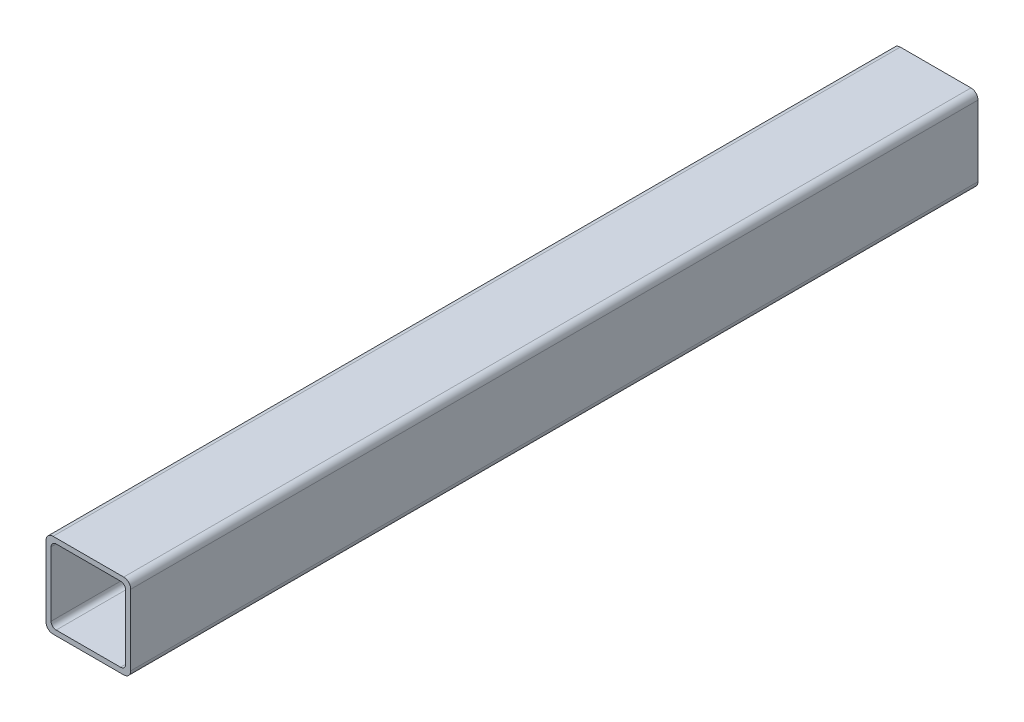
ISO-10303-21;
HEADER;
FILE_DESCRIPTION(('STEP AP214'),'2;1');
FILE_NAME('part.step','',(''),(''),'','','');
FILE_SCHEMA(('AUTOMOTIVE_DESIGN { 1 0 10303 214 1 1 1 1 }'));
ENDSEC;
DATA;
#1=APPLICATION_CONTEXT('core data for automotive mechanical design processes');
#2=APPLICATION_PROTOCOL_DEFINITION('international standard','automotive_design',2000,#1);
#3=PRODUCT_CONTEXT('',#1,'mechanical');
#4=PRODUCT('Part','Part','',(#3));
#5=PRODUCT_RELATED_PRODUCT_CATEGORY('part','',(#4));
#6=PRODUCT_DEFINITION_FORMATION('','',#4);
#7=PRODUCT_DEFINITION_CONTEXT('part definition',#1,'design');
#8=PRODUCT_DEFINITION('design','',#6,#7);
#9=PRODUCT_DEFINITION_SHAPE('','',#8);
#10=(LENGTH_UNIT() NAMED_UNIT(*) SI_UNIT(.MILLI.,.METRE.));
#11=(NAMED_UNIT(*) PLANE_ANGLE_UNIT() SI_UNIT($,.RADIAN.));
#12=(NAMED_UNIT(*) SI_UNIT($,.STERADIAN.) SOLID_ANGLE_UNIT());
#13=UNCERTAINTY_MEASURE_WITH_UNIT(LENGTH_MEASURE(1.E-05),#10,'distance_accuracy_value','');
#14=(GEOMETRIC_REPRESENTATION_CONTEXT(3) GLOBAL_UNCERTAINTY_ASSIGNED_CONTEXT((#13)) GLOBAL_UNIT_ASSIGNED_CONTEXT((#10,
#11,#12)) REPRESENTATION_CONTEXT('',''));
#15=CARTESIAN_POINT('',(0.,0.,0.));
#16=DIRECTION('',(0.,0.,1.));
#17=DIRECTION('',(1.,0.,0.));
#18=AXIS2_PLACEMENT_3D('',#15,#16,#17);
#19=CARTESIAN_POINT('',(-10.5917999999984,-10.5917999999984,-3429.));
#20=DIRECTION('',(0.,0.,-1.));
#21=DIRECTION('',(-1.,0.,0.));
#22=AXIS2_PLACEMENT_3D('',#19,#20,#21);
#23=CYLINDRICAL_SURFACE('',#22,2.10820000000163);
#24=CARTESIAN_POINT('',(-10.5917999999984,-10.5917999999984,-3683.));
#25=DIRECTION('',(0.,0.,-1.));
#26=DIRECTION('',(-1.,0.,0.));
#27=AXIS2_PLACEMENT_3D('',#24,#25,#26);
#28=CIRCLE('',#27,2.10820000000163);
#29=CARTESIAN_POINT('',(-10.5917999999984,-12.7,-3683.));
#30=VERTEX_POINT('',#29);
#31=CARTESIAN_POINT('',(-12.7,-10.5917999999984,-3683.));
#32=VERTEX_POINT('',#31);
#33=EDGE_CURVE('E202',#30,#32,#28,.T.);
#34=ORIENTED_EDGE('',*,*,#33,.F.);
#35=DIRECTION('',(0.,0.,-1.));
#36=VECTOR('',#35,1.);
#37=CARTESIAN_POINT('',(-10.5917999999984,-12.7,-3429.));
#38=LINE('',#37,#36);
#39=CARTESIAN_POINT('',(-10.5917999999984,-12.7,-3429.));
#40=VERTEX_POINT('',#39);
#41=EDGE_CURVE('E11',#40,#30,#38,.T.);
#42=ORIENTED_EDGE('',*,*,#41,.F.);
#43=CARTESIAN_POINT('',(-10.5917999999984,-10.5917999999984,-3429.));
#44=DIRECTION('',(0.,0.,-1.));
#45=DIRECTION('',(-1.,0.,0.));
#46=AXIS2_PLACEMENT_3D('',#43,#44,#45);
#47=CIRCLE('',#46,2.10820000000163);
#48=CARTESIAN_POINT('',(-12.7,-10.5917999999984,-3429.));
#49=VERTEX_POINT('',#48);
#50=EDGE_CURVE('E214',#40,#49,#47,.T.);
#51=ORIENTED_EDGE('',*,*,#50,.T.);
#52=DIRECTION('',(0.,0.,-1.));
#53=VECTOR('',#52,1.);
#54=CARTESIAN_POINT('',(-12.7,-10.5917999999984,-3429.));
#55=LINE('',#54,#53);
#56=EDGE_CURVE('E35',#49,#32,#55,.T.);
#57=ORIENTED_EDGE('',*,*,#56,.T.);
#58=EDGE_LOOP('',(#34,#42,#51,#57));
#59=FACE_BOUND('',#58,.T.);
#60=ADVANCED_FACE('F32',(#59),#23,.T.);
#61=CARTESIAN_POINT('',(10.5917999999984,-12.7,-3429.));
#62=DIRECTION('',(0.,-1.,0.));
#63=DIRECTION('',(1.,0.,0.));
#64=AXIS2_PLACEMENT_3D('',#61,#62,#63);
#65=PLANE('',#64);
#66=DIRECTION('',(-1.,0.,0.));
#67=VECTOR('',#66,1.);
#68=CARTESIAN_POINT('',(10.5917999999984,-12.7,-3683.));
#69=LINE('',#68,#67);
#70=CARTESIAN_POINT('',(10.5917999999984,-12.7,-3683.));
#71=VERTEX_POINT('',#70);
#72=EDGE_CURVE('E218',#71,#30,#69,.T.);
#73=ORIENTED_EDGE('',*,*,#72,.F.);
#74=DIRECTION('',(0.,0.,-1.));
#75=VECTOR('',#74,1.);
#76=CARTESIAN_POINT('',(10.5917999999984,-12.7,-3429.));
#77=LINE('',#76,#75);
#78=CARTESIAN_POINT('',(10.5917999999984,-12.7,-3429.));
#79=VERTEX_POINT('',#78);
#80=EDGE_CURVE('E40',#79,#71,#77,.T.);
#81=ORIENTED_EDGE('',*,*,#80,.F.);
#82=DIRECTION('',(-1.,0.,0.));
#83=VECTOR('',#82,1.);
#84=CARTESIAN_POINT('',(10.5917999999984,-12.7,-3429.));
#85=LINE('',#84,#83);
#86=EDGE_CURVE('E236',#79,#40,#85,.T.);
#87=ORIENTED_EDGE('',*,*,#86,.T.);
#88=ORIENTED_EDGE('',*,*,#41,.T.);
#89=EDGE_LOOP('',(#73,#81,#87,#88));
#90=FACE_BOUND('',#89,.T.);
#91=ADVANCED_FACE('F283',(#90),#65,.T.);
#92=CARTESIAN_POINT('',(10.5917999999984,-10.5917999999984,-3429.));
#93=DIRECTION('',(0.,0.,-1.));
#94=DIRECTION('',(-1.,0.,0.));
#95=AXIS2_PLACEMENT_3D('',#92,#93,#94);
#96=CYLINDRICAL_SURFACE('',#95,2.10820000000163);
#97=CARTESIAN_POINT('',(10.5917999999984,-10.5917999999984,-3683.));
#98=DIRECTION('',(0.,0.,-1.));
#99=DIRECTION('',(-1.,0.,0.));
#100=AXIS2_PLACEMENT_3D('',#97,#98,#99);
#101=CIRCLE('',#100,2.10820000000163);
#102=CARTESIAN_POINT('',(12.7,-10.5917999999984,-3683.));
#103=VERTEX_POINT('',#102);
#104=EDGE_CURVE('E256',#103,#71,#101,.T.);
#105=ORIENTED_EDGE('',*,*,#104,.F.);
#106=DIRECTION('',(0.,0.,-1.));
#107=VECTOR('',#106,1.);
#108=CARTESIAN_POINT('',(12.7,-10.5917999999984,-3429.));
#109=LINE('',#108,#107);
#110=CARTESIAN_POINT('',(12.7,-10.5917999999984,-3429.));
#111=VERTEX_POINT('',#110);
#112=EDGE_CURVE('E262',#111,#103,#109,.T.);
#113=ORIENTED_EDGE('',*,*,#112,.F.);
#114=CARTESIAN_POINT('',(10.5917999999984,-10.5917999999984,-3429.));
#115=DIRECTION('',(0.,0.,-1.));
#116=DIRECTION('',(-1.,0.,0.));
#117=AXIS2_PLACEMENT_3D('',#114,#115,#116);
#118=CIRCLE('',#117,2.10820000000163);
#119=EDGE_CURVE('E233',#111,#79,#118,.T.);
#120=ORIENTED_EDGE('',*,*,#119,.T.);
#121=ORIENTED_EDGE('',*,*,#80,.T.);
#122=EDGE_LOOP('',(#105,#113,#120,#121));
#123=FACE_BOUND('',#122,.T.);
#124=ADVANCED_FACE('F302',(#123),#96,.T.);
#125=CARTESIAN_POINT('',(12.7,10.5917999999984,-3429.));
#126=DIRECTION('',(1.,0.,0.));
#127=DIRECTION('',(0.,1.,0.));
#128=AXIS2_PLACEMENT_3D('',#125,#126,#127);
#129=PLANE('',#128);
#130=DIRECTION('',(0.,-1.,0.));
#131=VECTOR('',#130,1.);
#132=CARTESIAN_POINT('',(12.7,10.5917999999984,-3683.));
#133=LINE('',#132,#131);
#134=CARTESIAN_POINT('',(12.7,10.5917999999984,-3683.));
#135=VERTEX_POINT('',#134);
#136=EDGE_CURVE('E253',#135,#103,#133,.T.);
#137=ORIENTED_EDGE('',*,*,#136,.F.);
#138=DIRECTION('',(0.,0.,-1.));
#139=VECTOR('',#138,1.);
#140=CARTESIAN_POINT('',(12.7,10.5917999999984,-3429.));
#141=LINE('',#140,#139);
#142=CARTESIAN_POINT('',(12.7,10.5917999999984,-3429.));
#143=VERTEX_POINT('',#142);
#144=EDGE_CURVE('E264',#143,#135,#141,.T.);
#145=ORIENTED_EDGE('',*,*,#144,.F.);
#146=DIRECTION('',(0.,-1.,0.));
#147=VECTOR('',#146,1.);
#148=CARTESIAN_POINT('',(12.7,10.5917999999984,-3429.));
#149=LINE('',#148,#147);
#150=EDGE_CURVE('E230',#143,#111,#149,.T.);
#151=ORIENTED_EDGE('',*,*,#150,.T.);
#152=ORIENTED_EDGE('',*,*,#112,.T.);
#153=EDGE_LOOP('',(#137,#145,#151,#152));
#154=FACE_BOUND('',#153,.T.);
#155=ADVANCED_FACE('F300',(#154),#129,.T.);
#156=CARTESIAN_POINT('',(10.5917999999984,10.5917999999984,-3429.));
#157=DIRECTION('',(0.,0.,-1.));
#158=DIRECTION('',(-1.,0.,0.));
#159=AXIS2_PLACEMENT_3D('',#156,#157,#158);
#160=CYLINDRICAL_SURFACE('',#159,2.10820000000163);
#161=CARTESIAN_POINT('',(10.5917999999984,10.5917999999984,-3683.));
#162=DIRECTION('',(0.,0.,-1.));
#163=DIRECTION('',(-1.,0.,0.));
#164=AXIS2_PLACEMENT_3D('',#161,#162,#163);
#165=CIRCLE('',#164,2.10820000000163);
#166=CARTESIAN_POINT('',(10.5917999999984,12.7,-3683.));
#167=VERTEX_POINT('',#166);
#168=EDGE_CURVE('E250',#167,#135,#165,.T.);
#169=ORIENTED_EDGE('',*,*,#168,.F.);
#170=DIRECTION('',(0.,0.,-1.));
#171=VECTOR('',#170,1.);
#172=CARTESIAN_POINT('',(10.5917999999984,12.7,-3429.));
#173=LINE('',#172,#171);
#174=CARTESIAN_POINT('',(10.5917999999984,12.7,-3429.));
#175=VERTEX_POINT('',#174);
#176=EDGE_CURVE('E266',#175,#167,#173,.T.);
#177=ORIENTED_EDGE('',*,*,#176,.F.);
#178=CARTESIAN_POINT('',(10.5917999999984,10.5917999999984,-3429.));
#179=DIRECTION('',(0.,0.,-1.));
#180=DIRECTION('',(-1.,0.,0.));
#181=AXIS2_PLACEMENT_3D('',#178,#179,#180);
#182=CIRCLE('',#181,2.10820000000163);
#183=EDGE_CURVE('E227',#175,#143,#182,.T.);
#184=ORIENTED_EDGE('',*,*,#183,.T.);
#185=ORIENTED_EDGE('',*,*,#144,.T.);
#186=EDGE_LOOP('',(#169,#177,#184,#185));
#187=FACE_BOUND('',#186,.T.);
#188=ADVANCED_FACE('F296',(#187),#160,.T.);
#189=CARTESIAN_POINT('',(-10.5917999999984,12.7,-3429.));
#190=DIRECTION('',(0.,1.,0.));
#191=DIRECTION('',(-1.,0.,0.));
#192=AXIS2_PLACEMENT_3D('',#189,#190,#191);
#193=PLANE('',#192);
#194=DIRECTION('',(1.,0.,0.));
#195=VECTOR('',#194,1.);
#196=CARTESIAN_POINT('',(-10.5917999999984,12.7,-3683.));
#197=LINE('',#196,#195);
#198=CARTESIAN_POINT('',(-10.5917999999984,12.7,-3683.));
#199=VERTEX_POINT('',#198);
#200=EDGE_CURVE('E247',#199,#167,#197,.T.);
#201=ORIENTED_EDGE('',*,*,#200,.F.);
#202=DIRECTION('',(0.,0.,-1.));
#203=VECTOR('',#202,1.);
#204=CARTESIAN_POINT('',(-10.5917999999984,12.7,-3429.));
#205=LINE('',#204,#203);
#206=CARTESIAN_POINT('',(-10.5917999999984,12.7,-3429.));
#207=VERTEX_POINT('',#206);
#208=EDGE_CURVE('E268',#207,#199,#205,.T.);
#209=ORIENTED_EDGE('',*,*,#208,.F.);
#210=DIRECTION('',(1.,0.,0.));
#211=VECTOR('',#210,1.);
#212=CARTESIAN_POINT('',(-10.5917999999984,12.7,-3429.));
#213=LINE('',#212,#211);
#214=EDGE_CURVE('E224',#207,#175,#213,.T.);
#215=ORIENTED_EDGE('',*,*,#214,.T.);
#216=ORIENTED_EDGE('',*,*,#176,.T.);
#217=EDGE_LOOP('',(#201,#209,#215,#216));
#218=FACE_BOUND('',#217,.T.);
#219=ADVANCED_FACE('F294',(#218),#193,.T.);
#220=CARTESIAN_POINT('',(-10.5917999999984,10.5917999999984,-3429.));
#221=DIRECTION('',(0.,0.,-1.));
#222=DIRECTION('',(-1.,0.,0.));
#223=AXIS2_PLACEMENT_3D('',#220,#221,#222);
#224=CYLINDRICAL_SURFACE('',#223,2.10820000000163);
#225=CARTESIAN_POINT('',(-10.5917999999984,10.5917999999984,-3683.));
#226=DIRECTION('',(0.,0.,-1.));
#227=DIRECTION('',(-1.,0.,0.));
#228=AXIS2_PLACEMENT_3D('',#225,#226,#227);
#229=CIRCLE('',#228,2.10820000000163);
#230=CARTESIAN_POINT('',(-12.7,10.5917999999984,-3683.));
#231=VERTEX_POINT('',#230);
#232=EDGE_CURVE('E244',#231,#199,#229,.T.);
#233=ORIENTED_EDGE('',*,*,#232,.F.);
#234=DIRECTION('',(0.,0.,-1.));
#235=VECTOR('',#234,1.);
#236=CARTESIAN_POINT('',(-12.7,10.5917999999984,-3429.));
#237=LINE('',#236,#235);
#238=CARTESIAN_POINT('',(-12.7,10.5917999999984,-3429.));
#239=VERTEX_POINT('',#238);
#240=EDGE_CURVE('E269',#239,#231,#237,.T.);
#241=ORIENTED_EDGE('',*,*,#240,.F.);
#242=CARTESIAN_POINT('',(-10.5917999999984,10.5917999999984,-3429.));
#243=DIRECTION('',(0.,0.,-1.));
#244=DIRECTION('',(-1.,0.,0.));
#245=AXIS2_PLACEMENT_3D('',#242,#243,#244);
#246=CIRCLE('',#245,2.10820000000163);
#247=EDGE_CURVE('E221',#239,#207,#246,.T.);
#248=ORIENTED_EDGE('',*,*,#247,.T.);
#249=ORIENTED_EDGE('',*,*,#208,.T.);
#250=EDGE_LOOP('',(#233,#241,#248,#249));
#251=FACE_BOUND('',#250,.T.);
#252=ADVANCED_FACE('F290',(#251),#224,.T.);
#253=CARTESIAN_POINT('',(-12.7,-10.5917999999984,-3429.));
#254=DIRECTION('',(-1.,0.,0.));
#255=DIRECTION('',(0.,0.,1.));
#256=AXIS2_PLACEMENT_3D('',#253,#254,#255);
#257=PLANE('',#256);
#258=DIRECTION('',(0.,1.,0.));
#259=VECTOR('',#258,1.);
#260=CARTESIAN_POINT('',(-12.7,-10.5917999999984,-3683.));
#261=LINE('',#260,#259);
#262=EDGE_CURVE('E241',#32,#231,#261,.T.);
#263=ORIENTED_EDGE('',*,*,#262,.F.);
#264=ORIENTED_EDGE('',*,*,#56,.F.);
#265=DIRECTION('',(0.,1.,0.));
#266=VECTOR('',#265,1.);
#267=CARTESIAN_POINT('',(-12.7,-10.5917999999984,-3429.));
#268=LINE('',#267,#266);
#269=EDGE_CURVE('E217',#49,#239,#268,.T.);
#270=ORIENTED_EDGE('',*,*,#269,.T.);
#271=ORIENTED_EDGE('',*,*,#240,.T.);
#272=EDGE_LOOP('',(#263,#264,#270,#271));
#273=FACE_BOUND('',#272,.T.);
#274=ADVANCED_FACE('F277',(#273),#257,.T.);
#275=CARTESIAN_POINT('',(-10.5917999999984,-10.5917999999984,-3429.));
#276=DIRECTION('',(0.,0.,-1.));
#277=DIRECTION('',(-1.,0.,0.));
#278=AXIS2_PLACEMENT_3D('',#275,#276,#277);
#279=PLANE('',#278);
#280=DIRECTION('',(0.,1.,0.));
#281=VECTOR('',#280,1.);
#282=CARTESIAN_POINT('',(-11.176,9.65199999999898,-3429.));
#283=LINE('',#282,#281);
#284=CARTESIAN_POINT('',(-11.176,-9.65199999999898,-3429.));
#285=VERTEX_POINT('',#284);
#286=CARTESIAN_POINT('',(-11.176,9.65199999999898,-3429.));
#287=VERTEX_POINT('',#286);
#288=EDGE_CURVE('E153',#285,#287,#283,.T.);
#289=ORIENTED_EDGE('',*,*,#288,.T.);
#290=CARTESIAN_POINT('',(-9.65199999999898,9.65199999999898,-3429.));
#291=DIRECTION('',(0.,0.,-1.));
#292=DIRECTION('',(1.,0.,0.));
#293=AXIS2_PLACEMENT_3D('',#290,#291,#292);
#294=CIRCLE('',#293,1.52400000000102);
#295=CARTESIAN_POINT('',(-9.65199999999898,11.176,-3429.));
#296=VERTEX_POINT('',#295);
#297=EDGE_CURVE('E147',#287,#296,#294,.T.);
#298=ORIENTED_EDGE('',*,*,#297,.T.);
#299=DIRECTION('',(1.,0.,0.));
#300=VECTOR('',#299,1.);
#301=CARTESIAN_POINT('',(9.65199999999898,11.176,-3429.));
#302=LINE('',#301,#300);
#303=CARTESIAN_POINT('',(9.65199999999898,11.176,-3429.));
#304=VERTEX_POINT('',#303);
#305=EDGE_CURVE('E156',#296,#304,#302,.T.);
#306=ORIENTED_EDGE('',*,*,#305,.T.);
#307=CARTESIAN_POINT('',(9.65199999999898,9.65199999999898,-3429.));
#308=DIRECTION('',(0.,0.,-1.));
#309=DIRECTION('',(1.,0.,0.));
#310=AXIS2_PLACEMENT_3D('',#307,#308,#309);
#311=CIRCLE('',#310,1.52400000000102);
#312=CARTESIAN_POINT('',(11.176,9.65199999999898,-3429.));
#313=VERTEX_POINT('',#312);
#314=EDGE_CURVE('E48',#304,#313,#311,.T.);
#315=ORIENTED_EDGE('',*,*,#314,.T.);
#316=DIRECTION('',(0.,-1.,0.));
#317=VECTOR('',#316,1.);
#318=CARTESIAN_POINT('',(11.176,-9.65199999999898,-3429.));
#319=LINE('',#318,#317);
#320=CARTESIAN_POINT('',(11.176,-9.65199999999898,-3429.));
#321=VERTEX_POINT('',#320);
#322=EDGE_CURVE('E171',#313,#321,#319,.T.);
#323=ORIENTED_EDGE('',*,*,#322,.T.);
#324=CARTESIAN_POINT('',(9.65199999999898,-9.65199999999898,-3429.));
#325=DIRECTION('',(0.,0.,-1.));
#326=DIRECTION('',(1.,0.,0.));
#327=AXIS2_PLACEMENT_3D('',#324,#325,#326);
#328=CIRCLE('',#327,1.52400000000102);
#329=CARTESIAN_POINT('',(9.65199999999898,-11.176,-3429.));
#330=VERTEX_POINT('',#329);
#331=EDGE_CURVE('E174',#321,#330,#328,.T.);
#332=ORIENTED_EDGE('',*,*,#331,.T.);
#333=DIRECTION('',(-1.,0.,0.));
#334=VECTOR('',#333,1.);
#335=CARTESIAN_POINT('',(-9.65199999999898,-11.176,-3429.));
#336=LINE('',#335,#334);
#337=CARTESIAN_POINT('',(-9.65199999999898,-11.176,-3429.));
#338=VERTEX_POINT('',#337);
#339=EDGE_CURVE('E177',#330,#338,#336,.T.);
#340=ORIENTED_EDGE('',*,*,#339,.T.);
#341=CARTESIAN_POINT('',(-9.65199999999898,-9.65199999999898,-3429.));
#342=DIRECTION('',(0.,0.,-1.));
#343=DIRECTION('',(1.,0.,0.));
#344=AXIS2_PLACEMENT_3D('',#341,#342,#343);
#345=CIRCLE('',#344,1.52400000000102);
#346=EDGE_CURVE('E180',#338,#285,#345,.T.);
#347=ORIENTED_EDGE('',*,*,#346,.T.);
#348=EDGE_LOOP('',(#289,#298,#306,#315,#323,#332,#340,#347));
#349=FACE_BOUND('',#348,.T.);
#350=ORIENTED_EDGE('',*,*,#50,.F.);
#351=ORIENTED_EDGE('',*,*,#86,.F.);
#352=ORIENTED_EDGE('',*,*,#119,.F.);
#353=ORIENTED_EDGE('',*,*,#150,.F.);
#354=ORIENTED_EDGE('',*,*,#183,.F.);
#355=ORIENTED_EDGE('',*,*,#214,.F.);
#356=ORIENTED_EDGE('',*,*,#247,.F.);
#357=ORIENTED_EDGE('',*,*,#269,.F.);
#358=EDGE_LOOP('',(#350,#351,#352,#353,#354,#355,#356,#357));
#359=FACE_BOUND('',#358,.T.);
#360=ADVANCED_FACE('F160',(#349,#359),#279,.F.);
#361=CARTESIAN_POINT('',(-10.5917999999984,-10.5917999999984,-3683.));
#362=DIRECTION('',(0.,0.,-1.));
#363=DIRECTION('',(-1.,0.,0.));
#364=AXIS2_PLACEMENT_3D('',#361,#362,#363);
#365=PLANE('',#364);
#366=CARTESIAN_POINT('',(-9.65199999999898,9.65199999999898,-3683.));
#367=DIRECTION('',(0.,0.,-1.));
#368=DIRECTION('',(1.,0.,0.));
#369=AXIS2_PLACEMENT_3D('',#366,#367,#368);
#370=CIRCLE('',#369,1.52400000000102);
#371=CARTESIAN_POINT('',(-11.176,9.65199999999898,-3683.));
#372=VERTEX_POINT('',#371);
#373=CARTESIAN_POINT('',(-9.65199999999898,11.176,-3683.));
#374=VERTEX_POINT('',#373);
#375=EDGE_CURVE('E56',#372,#374,#370,.T.);
#376=ORIENTED_EDGE('',*,*,#375,.F.);
#377=DIRECTION('',(0.,1.,0.));
#378=VECTOR('',#377,1.);
#379=CARTESIAN_POINT('',(-11.176,9.65199999999898,-3683.));
#380=LINE('',#379,#378);
#381=CARTESIAN_POINT('',(-11.176,-9.65199999999898,-3683.));
#382=VERTEX_POINT('',#381);
#383=EDGE_CURVE('E164',#382,#372,#380,.T.);
#384=ORIENTED_EDGE('',*,*,#383,.F.);
#385=CARTESIAN_POINT('',(-9.65199999999898,-9.65199999999898,-3683.));
#386=DIRECTION('',(0.,0.,-1.));
#387=DIRECTION('',(1.,0.,0.));
#388=AXIS2_PLACEMENT_3D('',#385,#386,#387);
#389=CIRCLE('',#388,1.52400000000102);
#390=CARTESIAN_POINT('',(-9.65199999999898,-11.176,-3683.));
#391=VERTEX_POINT('',#390);
#392=EDGE_CURVE('E167',#391,#382,#389,.T.);
#393=ORIENTED_EDGE('',*,*,#392,.F.);
#394=DIRECTION('',(-1.,0.,0.));
#395=VECTOR('',#394,1.);
#396=CARTESIAN_POINT('',(-9.65199999999898,-11.176,-3683.));
#397=LINE('',#396,#395);
#398=CARTESIAN_POINT('',(9.65199999999898,-11.176,-3683.));
#399=VERTEX_POINT('',#398);
#400=EDGE_CURVE('E195',#399,#391,#397,.T.);
#401=ORIENTED_EDGE('',*,*,#400,.F.);
#402=CARTESIAN_POINT('',(9.65199999999898,-9.65199999999898,-3683.));
#403=DIRECTION('',(0.,0.,-1.));
#404=DIRECTION('',(1.,0.,0.));
#405=AXIS2_PLACEMENT_3D('',#402,#403,#404);
#406=CIRCLE('',#405,1.52400000000102);
#407=CARTESIAN_POINT('',(11.176,-9.65199999999898,-3683.));
#408=VERTEX_POINT('',#407);
#409=EDGE_CURVE('E192',#408,#399,#406,.T.);
#410=ORIENTED_EDGE('',*,*,#409,.F.);
#411=DIRECTION('',(0.,-1.,0.));
#412=VECTOR('',#411,1.);
#413=CARTESIAN_POINT('',(11.176,-9.65199999999898,-3683.));
#414=LINE('',#413,#412);
#415=CARTESIAN_POINT('',(11.176,9.65199999999898,-3683.));
#416=VERTEX_POINT('',#415);
#417=EDGE_CURVE('E189',#416,#408,#414,.T.);
#418=ORIENTED_EDGE('',*,*,#417,.F.);
#419=CARTESIAN_POINT('',(9.65199999999898,9.65199999999898,-3683.));
#420=DIRECTION('',(0.,0.,-1.));
#421=DIRECTION('',(1.,0.,0.));
#422=AXIS2_PLACEMENT_3D('',#419,#420,#421);
#423=CIRCLE('',#422,1.52400000000102);
#424=CARTESIAN_POINT('',(9.65199999999898,11.176,-3683.));
#425=VERTEX_POINT('',#424);
#426=EDGE_CURVE('E186',#425,#416,#423,.T.);
#427=ORIENTED_EDGE('',*,*,#426,.F.);
#428=DIRECTION('',(1.,0.,0.));
#429=VECTOR('',#428,1.);
#430=CARTESIAN_POINT('',(9.65199999999898,11.176,-3683.));
#431=LINE('',#430,#429);
#432=EDGE_CURVE('E184',#374,#425,#431,.T.);
#433=ORIENTED_EDGE('',*,*,#432,.F.);
#434=EDGE_LOOP('',(#376,#384,#393,#401,#410,#418,#427,#433));
#435=FACE_BOUND('',#434,.T.);
#436=ORIENTED_EDGE('',*,*,#33,.T.);
#437=ORIENTED_EDGE('',*,*,#262,.T.);
#438=ORIENTED_EDGE('',*,*,#232,.T.);
#439=ORIENTED_EDGE('',*,*,#200,.T.);
#440=ORIENTED_EDGE('',*,*,#168,.T.);
#441=ORIENTED_EDGE('',*,*,#136,.T.);
#442=ORIENTED_EDGE('',*,*,#104,.T.);
#443=ORIENTED_EDGE('',*,*,#72,.T.);
#444=EDGE_LOOP('',(#436,#437,#438,#439,#440,#441,#442,#443));
#445=FACE_BOUND('',#444,.T.);
#446=ADVANCED_FACE('F279',(#435,#445),#365,.T.);
#447=CARTESIAN_POINT('',(-9.65199999999898,9.65199999999898,-3429.));
#448=DIRECTION('',(0.,0.,-1.));
#449=DIRECTION('',(-1.,0.,0.));
#450=AXIS2_PLACEMENT_3D('',#447,#448,#449);
#451=CYLINDRICAL_SURFACE('',#450,1.52400000000102);
#452=ORIENTED_EDGE('',*,*,#375,.T.);
#453=DIRECTION('',(0.,0.,-1.));
#454=VECTOR('',#453,1.);
#455=CARTESIAN_POINT('',(-9.65199999999898,11.176,-3429.));
#456=LINE('',#455,#454);
#457=EDGE_CURVE('E143',#296,#374,#456,.T.);
#458=ORIENTED_EDGE('',*,*,#457,.F.);
#459=ORIENTED_EDGE('',*,*,#297,.F.);
#460=DIRECTION('',(0.,0.,-1.));
#461=VECTOR('',#460,1.);
#462=CARTESIAN_POINT('',(-11.176,9.65199999999898,-3429.));
#463=LINE('',#462,#461);
#464=EDGE_CURVE('E200',#287,#372,#463,.T.);
#465=ORIENTED_EDGE('',*,*,#464,.T.);
#466=EDGE_LOOP('',(#452,#458,#459,#465));
#467=FACE_BOUND('',#466,.T.);
#468=ADVANCED_FACE('F145',(#467),#451,.F.);
#469=CARTESIAN_POINT('',(-11.176,9.65199999999898,-3429.));
#470=DIRECTION('',(-1.,0.,0.));
#471=DIRECTION('',(0.,-1.,0.));
#472=AXIS2_PLACEMENT_3D('',#469,#470,#471);
#473=PLANE('',#472);
#474=ORIENTED_EDGE('',*,*,#383,.T.);
#475=ORIENTED_EDGE('',*,*,#464,.F.);
#476=ORIENTED_EDGE('',*,*,#288,.F.);
#477=DIRECTION('',(0.,0.,-1.));
#478=VECTOR('',#477,1.);
#479=CARTESIAN_POINT('',(-11.176,-9.65199999999898,-3429.));
#480=LINE('',#479,#478);
#481=EDGE_CURVE('E203',#285,#382,#480,.T.);
#482=ORIENTED_EDGE('',*,*,#481,.T.);
#483=EDGE_LOOP('',(#474,#475,#476,#482));
#484=FACE_BOUND('',#483,.T.);
#485=ADVANCED_FACE('F385',(#484),#473,.F.);
#486=CARTESIAN_POINT('',(-9.65199999999898,-9.65199999999898,-3429.));
#487=DIRECTION('',(0.,0.,-1.));
#488=DIRECTION('',(-1.,0.,0.));
#489=AXIS2_PLACEMENT_3D('',#486,#487,#488);
#490=CYLINDRICAL_SURFACE('',#489,1.52400000000102);
#491=ORIENTED_EDGE('',*,*,#392,.T.);
#492=ORIENTED_EDGE('',*,*,#481,.F.);
#493=ORIENTED_EDGE('',*,*,#346,.F.);
#494=DIRECTION('',(0.,0.,-1.));
#495=VECTOR('',#494,1.);
#496=CARTESIAN_POINT('',(-9.65199999999898,-11.176,-3429.));
#497=LINE('',#496,#495);
#498=EDGE_CURVE('E205',#338,#391,#497,.T.);
#499=ORIENTED_EDGE('',*,*,#498,.T.);
#500=EDGE_LOOP('',(#491,#492,#493,#499));
#501=FACE_BOUND('',#500,.T.);
#502=ADVANCED_FACE('F394',(#501),#490,.F.);
#503=CARTESIAN_POINT('',(-9.65199999999898,-11.176,-3429.));
#504=DIRECTION('',(0.,-1.,0.));
#505=DIRECTION('',(1.,0.,0.));
#506=AXIS2_PLACEMENT_3D('',#503,#504,#505);
#507=PLANE('',#506);
#508=ORIENTED_EDGE('',*,*,#400,.T.);
#509=ORIENTED_EDGE('',*,*,#498,.F.);
#510=ORIENTED_EDGE('',*,*,#339,.F.);
#511=DIRECTION('',(0.,0.,-1.));
#512=VECTOR('',#511,1.);
#513=CARTESIAN_POINT('',(9.65199999999898,-11.176,-3429.));
#514=LINE('',#513,#512);
#515=EDGE_CURVE('E207',#330,#399,#514,.T.);
#516=ORIENTED_EDGE('',*,*,#515,.T.);
#517=EDGE_LOOP('',(#508,#509,#510,#516));
#518=FACE_BOUND('',#517,.T.);
#519=ADVANCED_FACE('F404',(#518),#507,.F.);
#520=CARTESIAN_POINT('',(9.65199999999898,-9.65199999999898,-3429.));
#521=DIRECTION('',(0.,0.,-1.));
#522=DIRECTION('',(-1.,0.,0.));
#523=AXIS2_PLACEMENT_3D('',#520,#521,#522);
#524=CYLINDRICAL_SURFACE('',#523,1.52400000000102);
#525=ORIENTED_EDGE('',*,*,#409,.T.);
#526=ORIENTED_EDGE('',*,*,#515,.F.);
#527=ORIENTED_EDGE('',*,*,#331,.F.);
#528=DIRECTION('',(0.,0.,-1.));
#529=VECTOR('',#528,1.);
#530=CARTESIAN_POINT('',(11.176,-9.65199999999898,-3429.));
#531=LINE('',#530,#529);
#532=EDGE_CURVE('E209',#321,#408,#531,.T.);
#533=ORIENTED_EDGE('',*,*,#532,.T.);
#534=EDGE_LOOP('',(#525,#526,#527,#533));
#535=FACE_BOUND('',#534,.T.);
#536=ADVANCED_FACE('F414',(#535),#524,.F.);
#537=CARTESIAN_POINT('',(11.176,-9.65199999999898,-3429.));
#538=DIRECTION('',(1.,0.,0.));
#539=DIRECTION('',(0.,0.,-1.));
#540=AXIS2_PLACEMENT_3D('',#537,#538,#539);
#541=PLANE('',#540);
#542=ORIENTED_EDGE('',*,*,#417,.T.);
#543=ORIENTED_EDGE('',*,*,#532,.F.);
#544=ORIENTED_EDGE('',*,*,#322,.F.);
#545=DIRECTION('',(0.,0.,-1.));
#546=VECTOR('',#545,1.);
#547=CARTESIAN_POINT('',(11.176,9.65199999999898,-3429.));
#548=LINE('',#547,#546);
#549=EDGE_CURVE('E211',#313,#416,#548,.T.);
#550=ORIENTED_EDGE('',*,*,#549,.T.);
#551=EDGE_LOOP('',(#542,#543,#544,#550));
#552=FACE_BOUND('',#551,.T.);
#553=ADVANCED_FACE('F424',(#552),#541,.F.);
#554=CARTESIAN_POINT('',(9.65199999999898,9.65199999999898,-3429.));
#555=DIRECTION('',(0.,0.,-1.));
#556=DIRECTION('',(-1.,0.,0.));
#557=AXIS2_PLACEMENT_3D('',#554,#555,#556);
#558=CYLINDRICAL_SURFACE('',#557,1.52400000000102);
#559=ORIENTED_EDGE('',*,*,#426,.T.);
#560=ORIENTED_EDGE('',*,*,#549,.F.);
#561=ORIENTED_EDGE('',*,*,#314,.F.);
#562=DIRECTION('',(0.,0.,-1.));
#563=VECTOR('',#562,1.);
#564=CARTESIAN_POINT('',(9.65199999999898,11.176,-3429.));
#565=LINE('',#564,#563);
#566=EDGE_CURVE('E152',#304,#425,#565,.T.);
#567=ORIENTED_EDGE('',*,*,#566,.T.);
#568=EDGE_LOOP('',(#559,#560,#561,#567));
#569=FACE_BOUND('',#568,.T.);
#570=ADVANCED_FACE('F434',(#569),#558,.F.);
#571=CARTESIAN_POINT('',(9.65199999999898,11.176,-3429.));
#572=DIRECTION('',(0.,1.,0.));
#573=DIRECTION('',(0.,0.,1.));
#574=AXIS2_PLACEMENT_3D('',#571,#572,#573);
#575=PLANE('',#574);
#576=ORIENTED_EDGE('',*,*,#432,.T.);
#577=ORIENTED_EDGE('',*,*,#566,.F.);
#578=ORIENTED_EDGE('',*,*,#305,.F.);
#579=ORIENTED_EDGE('',*,*,#457,.T.);
#580=EDGE_LOOP('',(#576,#577,#578,#579));
#581=FACE_BOUND('',#580,.T.);
#582=ADVANCED_FACE('F157',(#581),#575,.F.);
#583=CLOSED_SHELL('',(#60,#91,#124,#155,#188,#219,#252,#274,#360,#446,#468,#485,#502,#519,#536,
#553,#570,#582));
#584=MANIFOLD_SOLID_BREP('B2',#583);
#585=ADVANCED_BREP_SHAPE_REPRESENTATION('',(#18,#584),#14);
#586=SHAPE_DEFINITION_REPRESENTATION(#9,#585);
ENDSEC;
END-ISO-10303-21;
